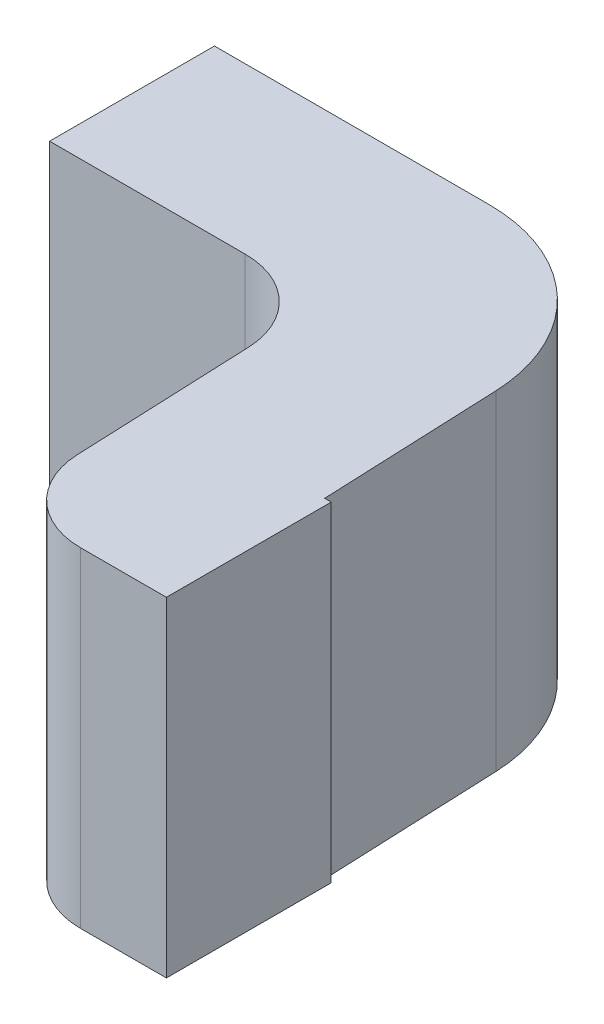
ISO-10303-21;
HEADER;
FILE_DESCRIPTION(('STEP AP214'),'2;1');
FILE_NAME('part.step','',(''),(''),'','','');
FILE_SCHEMA(('AUTOMOTIVE_DESIGN { 1 0 10303 214 1 1 1 1 }'));
ENDSEC;
DATA;
#1=APPLICATION_CONTEXT('core data for automotive mechanical design processes');
#2=APPLICATION_PROTOCOL_DEFINITION('international standard','automotive_design',2000,#1);
#3=PRODUCT_CONTEXT('',#1,'mechanical');
#4=PRODUCT('Part','Part','',(#3));
#5=PRODUCT_RELATED_PRODUCT_CATEGORY('part','',(#4));
#6=PRODUCT_DEFINITION_FORMATION('','',#4);
#7=PRODUCT_DEFINITION_CONTEXT('part definition',#1,'design');
#8=PRODUCT_DEFINITION('design','',#6,#7);
#9=PRODUCT_DEFINITION_SHAPE('','',#8);
#10=(LENGTH_UNIT() NAMED_UNIT(*) SI_UNIT(.MILLI.,.METRE.));
#11=(NAMED_UNIT(*) PLANE_ANGLE_UNIT() SI_UNIT($,.RADIAN.));
#12=(NAMED_UNIT(*) SI_UNIT($,.STERADIAN.) SOLID_ANGLE_UNIT());
#13=UNCERTAINTY_MEASURE_WITH_UNIT(LENGTH_MEASURE(1.E-05),#10,'distance_accuracy_value','');
#14=(GEOMETRIC_REPRESENTATION_CONTEXT(3) GLOBAL_UNCERTAINTY_ASSIGNED_CONTEXT((#13)) GLOBAL_UNIT_ASSIGNED_CONTEXT((#10,
#11,#12)) REPRESENTATION_CONTEXT('',''));
#15=CARTESIAN_POINT('',(0.,0.,0.));
#16=DIRECTION('',(0.,0.,1.));
#17=DIRECTION('',(1.,0.,0.));
#18=AXIS2_PLACEMENT_3D('',#15,#16,#17);
#19=CARTESIAN_POINT('',(-0.869222069455,0.75,0.246012646141));
#20=DIRECTION('',(0.,-1.,0.));
#21=DIRECTION('',(1.,0.,0.));
#22=AXIS2_PLACEMENT_3D('',#19,#20,#21);
#23=PLANE('',#22);
#24=DIRECTION('',(1.,0.,0.));
#25=VECTOR('',#24,1.);
#26=CARTESIAN_POINT('',(-1.2,0.75,0.2));
#27=LINE('',#26,#25);
#28=CARTESIAN_POINT('',(-1.2,0.75,0.2));
#29=VERTEX_POINT('',#28);
#30=CARTESIAN_POINT('',(-0.962760303737,0.75,0.2));
#31=VERTEX_POINT('',#30);
#32=EDGE_CURVE('E85',#29,#31,#27,.T.);
#33=ORIENTED_EDGE('',*,*,#32,.F.);
#34=DIRECTION('',(0.,0.,-1.));
#35=VECTOR('',#34,1.);
#36=CARTESIAN_POINT('',(-1.2,0.75,0.));
#37=LINE('',#36,#35);
#38=CARTESIAN_POINT('',(-1.2,0.75,0.));
#39=VERTEX_POINT('',#38);
#40=EDGE_CURVE('E91',#29,#39,#37,.T.);
#41=ORIENTED_EDGE('',*,*,#40,.T.);
#42=DIRECTION('',(1.,0.,0.));
#43=VECTOR('',#42,1.);
#44=CARTESIAN_POINT('',(-1.2,0.75,0.));
#45=LINE('',#44,#43);
#46=CARTESIAN_POINT('',(-0.866840202491,0.75,0.));
#47=VERTEX_POINT('',#46);
#48=EDGE_CURVE('E177',#39,#47,#45,.T.);
#49=ORIENTED_EDGE('',*,*,#48,.T.);
#50=CARTESIAN_POINT('',(-0.866840202491,0.75,0.2));
#51=DIRECTION('',(0.,1.,0.));
#52=DIRECTION('',(0.,0.,1.));
#53=AXIS2_PLACEMENT_3D('',#50,#51,#52);
#54=CIRCLE('',#53,0.2);
#55=CARTESIAN_POINT('',(-0.667013587872555,0.75,0.191673891057771));
#56=VERTEX_POINT('',#55);
#57=EDGE_CURVE('E203',#56,#47,#54,.T.);
#58=ORIENTED_EDGE('',*,*,#57,.F.);
#59=DIRECTION('',(-0.0416305447122046,0.,-0.999133073092351));
#60=VECTOR('',#59,1.);
#61=CARTESIAN_POINT('',(-0.675,0.75,0.));
#62=LINE('',#61,#60);
#63=CARTESIAN_POINT('',(-0.657986412127406,0.75,0.408326108942011));
#64=VERTEX_POINT('',#63);
#65=EDGE_CURVE('E120',#64,#56,#62,.T.);
#66=ORIENTED_EDGE('',*,*,#65,.F.);
#67=DIRECTION('',(1.,0.,0.));
#68=VECTOR('',#67,1.);
#69=CARTESIAN_POINT('',(-0.849826614618,0.75,0.408326108942));
#70=LINE('',#69,#68);
#71=CARTESIAN_POINT('',(-0.65,0.75,0.408326108942));
#72=VERTEX_POINT('',#71);
#73=EDGE_CURVE('E121',#64,#72,#70,.T.);
#74=ORIENTED_EDGE('',*,*,#73,.T.);
#75=DIRECTION('',(0.,0.,-1.));
#76=VECTOR('',#75,1.);
#77=CARTESIAN_POINT('',(-0.65,0.75,0.408326108942));
#78=LINE('',#77,#76);
#79=CARTESIAN_POINT('',(-0.65,0.75,0.608326108942));
#80=VERTEX_POINT('',#79);
#81=EDGE_CURVE('E117',#80,#72,#78,.T.);
#82=ORIENTED_EDGE('',*,*,#81,.F.);
#83=DIRECTION('',(1.,0.,0.));
#84=VECTOR('',#83,1.);
#85=CARTESIAN_POINT('',(-0.849826614618,0.75,0.608326108942));
#86=LINE('',#85,#84);
#87=CARTESIAN_POINT('',(-0.753906513373,0.75,0.608326108942));
#88=VERTEX_POINT('',#87);
#89=EDGE_CURVE('E150',#88,#80,#86,.T.);
#90=ORIENTED_EDGE('',*,*,#89,.F.);
#91=CARTESIAN_POINT('',(-0.753906513373,0.75,0.508326108942));
#92=DIRECTION('',(0.,1.,0.));
#93=DIRECTION('',(0.,0.,1.));
#94=AXIS2_PLACEMENT_3D('',#91,#92,#93);
#95=CIRCLE('',#94,0.1);
#96=CARTESIAN_POINT('',(-0.853819820681954,0.75,0.512489163413604));
#97=VERTEX_POINT('',#96);
#98=EDGE_CURVE('E154',#97,#88,#95,.T.);
#99=ORIENTED_EDGE('',*,*,#98,.F.);
#100=DIRECTION('',(-0.0416305447122046,0.,-0.999133073092351));
#101=VECTOR('',#100,1.);
#102=CARTESIAN_POINT('',(-0.874826614618,0.75,0.008326108942436));
#103=LINE('',#102,#101);
#104=CARTESIAN_POINT('',(-0.862846996426892,0.75,0.295836945528869));
#105=VERTEX_POINT('',#104);
#106=EDGE_CURVE('E78',#97,#105,#103,.T.);
#107=ORIENTED_EDGE('',*,*,#106,.T.);
#108=CARTESIAN_POINT('',(-0.962760303737,0.75,0.3));
#109=DIRECTION('',(0.,1.,0.));
#110=DIRECTION('',(0.,0.,1.));
#111=AXIS2_PLACEMENT_3D('',#108,#109,#110);
#112=CIRCLE('',#111,0.1);
#113=EDGE_CURVE('E19',#105,#31,#112,.T.);
#114=ORIENTED_EDGE('',*,*,#113,.T.);
#115=EDGE_LOOP('',(#33,#41,#49,#58,#66,#74,#82,#90,#99,#107,#114));
#116=FACE_BOUND('',#115,.T.);
#117=ADVANCED_FACE('F16',(#116),#23,.T.);
#118=CARTESIAN_POINT('',(-1.2,0.75,0.));
#119=DIRECTION('',(0.,0.,1.));
#120=DIRECTION('',(1.,0.,0.));
#121=AXIS2_PLACEMENT_3D('',#118,#119,#120);
#122=PLANE('',#121);
#123=ORIENTED_EDGE('',*,*,#48,.F.);
#124=DIRECTION('',(0.,1.,0.));
#125=VECTOR('',#124,1.);
#126=CARTESIAN_POINT('',(-1.2,0.75,0.));
#127=LINE('',#126,#125);
#128=CARTESIAN_POINT('',(-1.2,1.15,0.));
#129=VERTEX_POINT('',#128);
#130=EDGE_CURVE('E161',#39,#129,#127,.T.);
#131=ORIENTED_EDGE('',*,*,#130,.T.);
#132=DIRECTION('',(-1.,0.,0.));
#133=VECTOR('',#132,1.);
#134=CARTESIAN_POINT('',(-0.869222069455,1.15,0.));
#135=LINE('',#134,#133);
#136=CARTESIAN_POINT('',(-0.866840202491,1.15,0.));
#137=VERTEX_POINT('',#136);
#138=EDGE_CURVE('E168',#137,#129,#135,.T.);
#139=ORIENTED_EDGE('',*,*,#138,.F.);
#140=DIRECTION('',(0.,1.,0.));
#141=VECTOR('',#140,1.);
#142=CARTESIAN_POINT('',(-0.866840202491,0.75,0.));
#143=LINE('',#142,#141);
#144=EDGE_CURVE('E228',#47,#137,#143,.T.);
#145=ORIENTED_EDGE('',*,*,#144,.F.);
#146=EDGE_LOOP('',(#123,#131,#139,#145));
#147=FACE_BOUND('',#146,.T.);
#148=ADVANCED_FACE('F246',(#147),#122,.F.);
#149=CARTESIAN_POINT('',(-1.2,0.75,0.));
#150=DIRECTION('',(1.,0.,0.));
#151=DIRECTION('',(0.,0.,-1.));
#152=AXIS2_PLACEMENT_3D('',#149,#150,#151);
#153=PLANE('',#152);
#154=DIRECTION('',(0.,0.,1.));
#155=VECTOR('',#154,1.);
#156=CARTESIAN_POINT('',(-1.2,1.15,0.246012646141));
#157=LINE('',#156,#155);
#158=CARTESIAN_POINT('',(-1.2,1.15,0.2));
#159=VERTEX_POINT('',#158);
#160=EDGE_CURVE('E164',#129,#159,#157,.T.);
#161=ORIENTED_EDGE('',*,*,#160,.F.);
#162=ORIENTED_EDGE('',*,*,#130,.F.);
#163=ORIENTED_EDGE('',*,*,#40,.F.);
#164=DIRECTION('',(0.,1.,0.));
#165=VECTOR('',#164,1.);
#166=CARTESIAN_POINT('',(-1.2,0.75,0.2));
#167=LINE('',#166,#165);
#168=EDGE_CURVE('E159',#159,#29,#167,.F.);
#169=ORIENTED_EDGE('',*,*,#168,.F.);
#170=EDGE_LOOP('',(#161,#162,#163,#169));
#171=FACE_BOUND('',#170,.T.);
#172=ADVANCED_FACE('F248',(#171),#153,.F.);
#173=CARTESIAN_POINT('',(-1.2,0.75,0.2));
#174=DIRECTION('',(0.,0.,1.));
#175=DIRECTION('',(1.,0.,0.));
#176=AXIS2_PLACEMENT_3D('',#173,#174,#175);
#177=PLANE('',#176);
#178=ORIENTED_EDGE('',*,*,#32,.T.);
#179=DIRECTION('',(0.,1.,0.));
#180=VECTOR('',#179,1.);
#181=CARTESIAN_POINT('',(-0.962760303737,0.75,0.2));
#182=LINE('',#181,#180);
#183=CARTESIAN_POINT('',(-0.962760303737,1.15,0.2));
#184=VERTEX_POINT('',#183);
#185=EDGE_CURVE('E157',#31,#184,#182,.T.);
#186=ORIENTED_EDGE('',*,*,#185,.T.);
#187=DIRECTION('',(-1.,0.,0.));
#188=VECTOR('',#187,1.);
#189=CARTESIAN_POINT('',(-0.869222069455,1.15,0.2));
#190=LINE('',#189,#188);
#191=EDGE_CURVE('E167',#159,#184,#190,.F.);
#192=ORIENTED_EDGE('',*,*,#191,.F.);
#193=ORIENTED_EDGE('',*,*,#168,.T.);
#194=EDGE_LOOP('',(#178,#186,#192,#193));
#195=FACE_BOUND('',#194,.T.);
#196=ADVANCED_FACE('F250',(#195),#177,.T.);
#197=CARTESIAN_POINT('',(-0.962760303737,0.75,0.3));
#198=DIRECTION('',(0.,1.,0.));
#199=DIRECTION('',(0.,0.,1.));
#200=AXIS2_PLACEMENT_3D('',#197,#198,#199);
#201=CYLINDRICAL_SURFACE('',#200,0.1);
#202=DIRECTION('',(0.,1.,0.));
#203=VECTOR('',#202,1.);
#204=CARTESIAN_POINT('',(-0.862846996426887,0.75,0.295836945528995));
#205=LINE('',#204,#203);
#206=CARTESIAN_POINT('',(-0.862846996426947,1.15,0.295836945528921));
#207=VERTEX_POINT('',#206);
#208=EDGE_CURVE('E155',#105,#207,#205,.T.);
#209=ORIENTED_EDGE('',*,*,#208,.T.);
#210=CARTESIAN_POINT('',(-0.962760303737,1.15,0.3));
#211=DIRECTION('',(0.,1.,0.));
#212=DIRECTION('',(0.,0.,1.));
#213=AXIS2_PLACEMENT_3D('',#210,#211,#212);
#214=CIRCLE('',#213,0.1);
#215=EDGE_CURVE('E200',#184,#207,#214,.F.);
#216=ORIENTED_EDGE('',*,*,#215,.F.);
#217=ORIENTED_EDGE('',*,*,#185,.F.);
#218=ORIENTED_EDGE('',*,*,#113,.F.);
#219=EDGE_LOOP('',(#209,#216,#217,#218));
#220=FACE_BOUND('',#219,.T.);
#221=ADVANCED_FACE('F253',(#220),#201,.F.);
#222=CARTESIAN_POINT('',(-0.874826614618,0.75,0.008326108942436));
#223=DIRECTION('',(0.999133073092351,0.,-0.0416305447122046));
#224=DIRECTION('',(-0.0416305447122046,0.,-0.999133073092351));
#225=AXIS2_PLACEMENT_3D('',#222,#223,#224);
#226=PLANE('',#225);
#227=DIRECTION('',(0.0416305447112224,0.,0.999133073092392));
#228=VECTOR('',#227,1.);
#229=CARTESIAN_POINT('',(-0.862846996427,1.15,0.295836945529));
#230=LINE('',#229,#228);
#231=CARTESIAN_POINT('',(-0.853819820682119,1.15,0.512489163413561));
#232=VERTEX_POINT('',#231);
#233=EDGE_CURVE('E199',#207,#232,#230,.T.);
#234=ORIENTED_EDGE('',*,*,#233,.F.);
#235=ORIENTED_EDGE('',*,*,#208,.F.);
#236=ORIENTED_EDGE('',*,*,#106,.F.);
#237=DIRECTION('',(0.,1.,0.));
#238=VECTOR('',#237,1.);
#239=CARTESIAN_POINT('',(-0.853819820682202,0.75,0.512489163414008));
#240=LINE('',#239,#238);
#241=EDGE_CURVE('E151',#232,#97,#240,.F.);
#242=ORIENTED_EDGE('',*,*,#241,.F.);
#243=EDGE_LOOP('',(#234,#235,#236,#242));
#244=FACE_BOUND('',#243,.T.);
#245=ADVANCED_FACE('F254',(#244),#226,.F.);
#246=CARTESIAN_POINT('',(-0.753906513373,0.75,0.508326108942));
#247=DIRECTION('',(0.,1.,0.));
#248=DIRECTION('',(0.,0.,1.));
#249=AXIS2_PLACEMENT_3D('',#246,#247,#248);
#250=CYLINDRICAL_SURFACE('',#249,0.1);
#251=CARTESIAN_POINT('',(-0.753906513373,1.15,0.508326108942));
#252=DIRECTION('',(0.,1.,0.));
#253=DIRECTION('',(0.,0.,1.));
#254=AXIS2_PLACEMENT_3D('',#251,#252,#253);
#255=CIRCLE('',#254,0.1);
#256=CARTESIAN_POINT('',(-0.753906513373,1.15,0.608326108942));
#257=VERTEX_POINT('',#256);
#258=EDGE_CURVE('E136',#232,#257,#255,.T.);
#259=ORIENTED_EDGE('',*,*,#258,.F.);
#260=ORIENTED_EDGE('',*,*,#241,.T.);
#261=ORIENTED_EDGE('',*,*,#98,.T.);
#262=DIRECTION('',(0.,1.,0.));
#263=VECTOR('',#262,1.);
#264=CARTESIAN_POINT('',(-0.753906513373,0.75,0.608326108942));
#265=LINE('',#264,#263);
#266=EDGE_CURVE('E147',#257,#88,#265,.F.);
#267=ORIENTED_EDGE('',*,*,#266,.F.);
#268=EDGE_LOOP('',(#259,#260,#261,#267));
#269=FACE_BOUND('',#268,.T.);
#270=ADVANCED_FACE('F208',(#269),#250,.T.);
#271=CARTESIAN_POINT('',(-0.849826614618,0.75,0.608326108942));
#272=DIRECTION('',(0.,0.,1.));
#273=DIRECTION('',(1.,0.,0.));
#274=AXIS2_PLACEMENT_3D('',#271,#272,#273);
#275=PLANE('',#274);
#276=DIRECTION('',(-1.,0.,0.));
#277=VECTOR('',#276,1.);
#278=CARTESIAN_POINT('',(-0.869222069455,1.15,0.608326108942));
#279=LINE('',#278,#277);
#280=CARTESIAN_POINT('',(-0.65,1.15,0.608326108942));
#281=VERTEX_POINT('',#280);
#282=EDGE_CURVE('E134',#257,#281,#279,.F.);
#283=ORIENTED_EDGE('',*,*,#282,.F.);
#284=ORIENTED_EDGE('',*,*,#266,.T.);
#285=ORIENTED_EDGE('',*,*,#89,.T.);
#286=DIRECTION('',(0.,1.,0.));
#287=VECTOR('',#286,1.);
#288=CARTESIAN_POINT('',(-0.65,0.75,0.608326108942));
#289=LINE('',#288,#287);
#290=EDGE_CURVE('E143',#281,#80,#289,.F.);
#291=ORIENTED_EDGE('',*,*,#290,.F.);
#292=EDGE_LOOP('',(#283,#284,#285,#291));
#293=FACE_BOUND('',#292,.T.);
#294=ADVANCED_FACE('F210',(#293),#275,.T.);
#295=CARTESIAN_POINT('',(-0.65,0.75,0.408326108942));
#296=DIRECTION('',(1.,0.,0.));
#297=DIRECTION('',(0.,0.,-1.));
#298=AXIS2_PLACEMENT_3D('',#295,#296,#297);
#299=PLANE('',#298);
#300=DIRECTION('',(0.,0.,1.));
#301=VECTOR('',#300,1.);
#302=CARTESIAN_POINT('',(-0.65,1.15,0.246012646141));
#303=LINE('',#302,#301);
#304=CARTESIAN_POINT('',(-0.65,1.15,0.408326108942));
#305=VERTEX_POINT('',#304);
#306=EDGE_CURVE('E115',#281,#305,#303,.F.);
#307=ORIENTED_EDGE('',*,*,#306,.F.);
#308=ORIENTED_EDGE('',*,*,#290,.T.);
#309=ORIENTED_EDGE('',*,*,#81,.T.);
#310=DIRECTION('',(0.,1.,0.));
#311=VECTOR('',#310,1.);
#312=CARTESIAN_POINT('',(-0.65,0.75,0.408326108942));
#313=LINE('',#312,#311);
#314=EDGE_CURVE('E110',#72,#305,#313,.T.);
#315=ORIENTED_EDGE('',*,*,#314,.T.);
#316=EDGE_LOOP('',(#307,#308,#309,#315));
#317=FACE_BOUND('',#316,.T.);
#318=ADVANCED_FACE('F112',(#317),#299,.T.);
#319=CARTESIAN_POINT('',(-0.849826614618,0.75,0.408326108942));
#320=DIRECTION('',(0.,0.,1.));
#321=DIRECTION('',(1.,0.,0.));
#322=AXIS2_PLACEMENT_3D('',#319,#320,#321);
#323=PLANE('',#322);
#324=ORIENTED_EDGE('',*,*,#73,.F.);
#325=DIRECTION('',(0.,1.,0.));
#326=VECTOR('',#325,1.);
#327=CARTESIAN_POINT('',(-0.657986412127406,0.75,0.408326108942017));
#328=LINE('',#327,#326);
#329=CARTESIAN_POINT('',(-0.657986412127135,1.15,0.408326108942006));
#330=VERTEX_POINT('',#329);
#331=EDGE_CURVE('E127',#330,#64,#328,.F.);
#332=ORIENTED_EDGE('',*,*,#331,.F.);
#333=DIRECTION('',(-1.,0.,0.));
#334=VECTOR('',#333,1.);
#335=CARTESIAN_POINT('',(-0.869222069455,1.15,0.408326108942));
#336=LINE('',#335,#334);
#337=EDGE_CURVE('E124',#305,#330,#336,.T.);
#338=ORIENTED_EDGE('',*,*,#337,.F.);
#339=ORIENTED_EDGE('',*,*,#314,.F.);
#340=EDGE_LOOP('',(#324,#332,#338,#339));
#341=FACE_BOUND('',#340,.T.);
#342=ADVANCED_FACE('F125',(#341),#323,.F.);
#343=CARTESIAN_POINT('',(-0.675,0.75,0.));
#344=DIRECTION('',(0.999133073092351,0.,-0.0416305447122046));
#345=DIRECTION('',(-0.0416305447122046,0.,-0.999133073092351));
#346=AXIS2_PLACEMENT_3D('',#343,#344,#345);
#347=PLANE('',#346);
#348=DIRECTION('',(-0.0416305447160177,0.,-0.999133073092192));
#349=VECTOR('',#348,1.);
#350=CARTESIAN_POINT('',(-0.657986412127,1.15,0.408326108942));
#351=LINE('',#350,#349);
#352=CARTESIAN_POINT('',(-0.667013587872781,1.15,0.191673891057398));
#353=VERTEX_POINT('',#352);
#354=EDGE_CURVE('E25',#330,#353,#351,.T.);
#355=ORIENTED_EDGE('',*,*,#354,.F.);
#356=ORIENTED_EDGE('',*,*,#331,.T.);
#357=ORIENTED_EDGE('',*,*,#65,.T.);
#358=DIRECTION('',(0.,1.,0.));
#359=VECTOR('',#358,1.);
#360=CARTESIAN_POINT('',(-0.667013587872512,0.75,0.19167389105798));
#361=LINE('',#360,#359);
#362=EDGE_CURVE('E34',#353,#56,#361,.F.);
#363=ORIENTED_EDGE('',*,*,#362,.F.);
#364=EDGE_LOOP('',(#355,#356,#357,#363));
#365=FACE_BOUND('',#364,.T.);
#366=ADVANCED_FACE('F236',(#365),#347,.T.);
#367=CARTESIAN_POINT('',(-0.866840202491,0.75,0.2));
#368=DIRECTION('',(0.,1.,0.));
#369=DIRECTION('',(0.,0.,1.));
#370=AXIS2_PLACEMENT_3D('',#367,#368,#369);
#371=CYLINDRICAL_SURFACE('',#370,0.2);
#372=ORIENTED_EDGE('',*,*,#362,.T.);
#373=ORIENTED_EDGE('',*,*,#57,.T.);
#374=ORIENTED_EDGE('',*,*,#144,.T.);
#375=CARTESIAN_POINT('',(-0.866840202491,1.15,0.2));
#376=DIRECTION('',(0.,1.,0.));
#377=DIRECTION('',(0.,0.,1.));
#378=AXIS2_PLACEMENT_3D('',#375,#376,#377);
#379=CIRCLE('',#378,0.2);
#380=EDGE_CURVE('E11',#353,#137,#379,.T.);
#381=ORIENTED_EDGE('',*,*,#380,.F.);
#382=EDGE_LOOP('',(#372,#373,#374,#381));
#383=FACE_BOUND('',#382,.T.);
#384=ADVANCED_FACE('F242',(#383),#371,.T.);
#385=CARTESIAN_POINT('',(-0.869222069455,1.15,0.246012646141));
#386=DIRECTION('',(0.,1.,0.));
#387=DIRECTION('',(-1.,0.,0.));
#388=AXIS2_PLACEMENT_3D('',#385,#386,#387);
#389=PLANE('',#388);
#390=ORIENTED_EDGE('',*,*,#354,.T.);
#391=ORIENTED_EDGE('',*,*,#380,.T.);
#392=ORIENTED_EDGE('',*,*,#138,.T.);
#393=ORIENTED_EDGE('',*,*,#160,.T.);
#394=ORIENTED_EDGE('',*,*,#191,.T.);
#395=ORIENTED_EDGE('',*,*,#215,.T.);
#396=ORIENTED_EDGE('',*,*,#233,.T.);
#397=ORIENTED_EDGE('',*,*,#258,.T.);
#398=ORIENTED_EDGE('',*,*,#282,.T.);
#399=ORIENTED_EDGE('',*,*,#306,.T.);
#400=ORIENTED_EDGE('',*,*,#337,.T.);
#401=EDGE_LOOP('',(#390,#391,#392,#393,#394,#395,#396,#397,#398,#399,#400));
#402=FACE_BOUND('',#401,.T.);
#403=ADVANCED_FACE('F131',(#402),#389,.T.);
#404=CLOSED_SHELL('',(#117,#148,#172,#196,#221,#245,#270,#294,#318,#342,#366,#384,#403));
#405=MANIFOLD_SOLID_BREP('B1',#404);
#406=ADVANCED_BREP_SHAPE_REPRESENTATION('',(#18,#405),#14);
#407=SHAPE_DEFINITION_REPRESENTATION(#9,#406);
ENDSEC;
END-ISO-10303-21;
